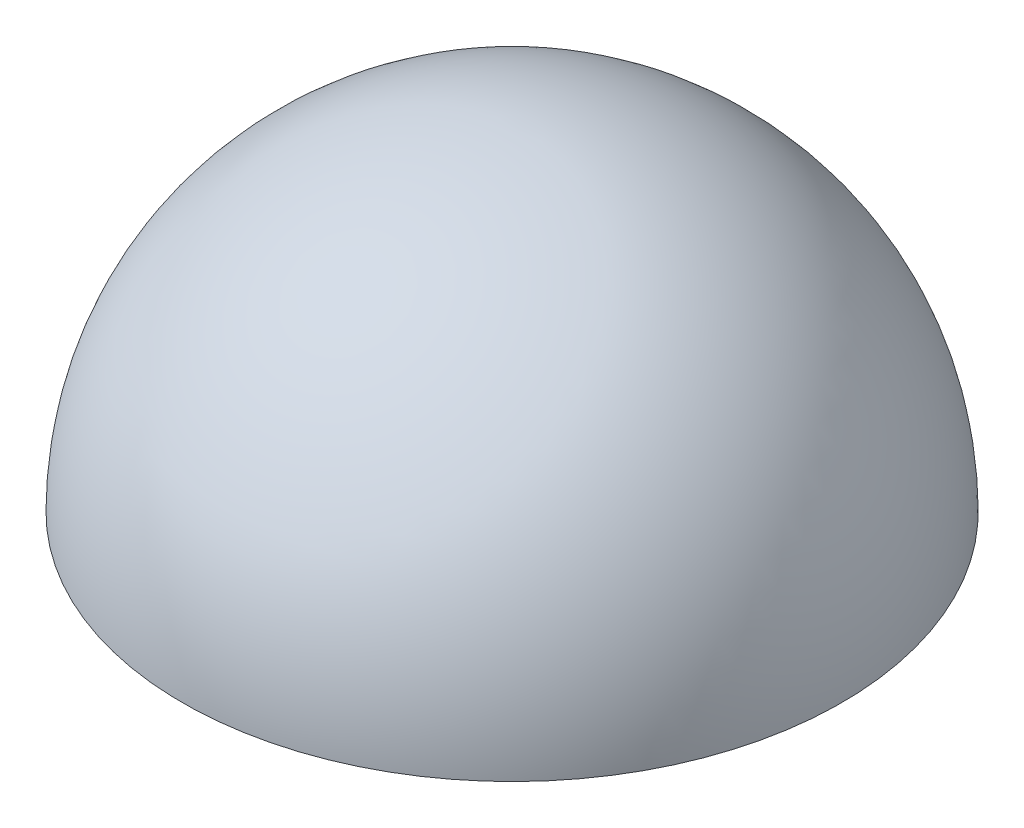
ISO-10303-21;
HEADER;
FILE_DESCRIPTION(('STEP AP214'),'2;1');
FILE_NAME('part.step','',(''),(''),'','','');
FILE_SCHEMA(('AUTOMOTIVE_DESIGN { 1 0 10303 214 1 1 1 1 }'));
ENDSEC;
DATA;
#1=APPLICATION_CONTEXT('core data for automotive mechanical design processes');
#2=APPLICATION_PROTOCOL_DEFINITION('international standard','automotive_design',2000,#1);
#3=PRODUCT_CONTEXT('',#1,'mechanical');
#4=PRODUCT('Part','Part','',(#3));
#5=PRODUCT_RELATED_PRODUCT_CATEGORY('part','',(#4));
#6=PRODUCT_DEFINITION_FORMATION('','',#4);
#7=PRODUCT_DEFINITION_CONTEXT('part definition',#1,'design');
#8=PRODUCT_DEFINITION('design','',#6,#7);
#9=PRODUCT_DEFINITION_SHAPE('','',#8);
#10=(LENGTH_UNIT() NAMED_UNIT(*) SI_UNIT(.MILLI.,.METRE.));
#11=(NAMED_UNIT(*) PLANE_ANGLE_UNIT() SI_UNIT($,.RADIAN.));
#12=(NAMED_UNIT(*) SI_UNIT($,.STERADIAN.) SOLID_ANGLE_UNIT());
#13=UNCERTAINTY_MEASURE_WITH_UNIT(LENGTH_MEASURE(1.E-05),#10,'distance_accuracy_value','');
#14=(GEOMETRIC_REPRESENTATION_CONTEXT(3) GLOBAL_UNCERTAINTY_ASSIGNED_CONTEXT((#13)) GLOBAL_UNIT_ASSIGNED_CONTEXT((#10,
#11,#12)) REPRESENTATION_CONTEXT('',''));
#15=CARTESIAN_POINT('',(0.,0.,0.));
#16=DIRECTION('',(0.,0.,1.));
#17=DIRECTION('',(1.,0.,0.));
#18=AXIS2_PLACEMENT_3D('',#15,#16,#17);
#19=CARTESIAN_POINT('',(0.,0.,0.));
#20=DIRECTION('',(-1.,0.,0.));
#21=DIRECTION('',(0.,0.,1.));
#22=AXIS2_PLACEMENT_3D('',#19,#20,#21);
#23=SPHERICAL_SURFACE('',#22,31.5);
#24=CARTESIAN_POINT('',(0.,0.,0.));
#25=DIRECTION('',(0.,-1.,0.));
#26=DIRECTION('',(0.,0.,-1.));
#27=AXIS2_PLACEMENT_3D('',#24,#25,#26);
#28=SPHERICAL_SURFACE('',#27,31.5);
#29=CARTESIAN_POINT('',(0.,0.,0.));
#30=DIRECTION('',(0.,-1.,0.));
#31=DIRECTION('',(0.,0.,-1.));
#32=AXIS2_PLACEMENT_3D('',#29,#30,#31);
#33=CIRCLE('',#32,31.5);
#34=CARTESIAN_POINT('',(0.,2.19963324347117E-13,-31.5));
#35=VERTEX_POINT('',#34);
#36=EDGE_CURVE('E45',#35,#35,#33,.T.);
#37=ORIENTED_EDGE('',*,*,#36,.F.);
#38=EDGE_LOOP('',(#37));
#39=FACE_BOUND('',#38,.T.);
#40=ADVANCED_FACE('F37',(#39),#28,.T.);
#41=CARTESIAN_POINT('',(0.,0.,0.));
#42=DIRECTION('',(-1.,0.,0.));
#43=DIRECTION('',(0.,0.,1.));
#44=AXIS2_PLACEMENT_3D('',#41,#42,#43);
#45=SPHERICAL_SURFACE('',#44,30.);
#46=CARTESIAN_POINT('',(0.,0.,0.));
#47=DIRECTION('',(0.,-1.,0.));
#48=DIRECTION('',(0.,0.,-1.));
#49=AXIS2_PLACEMENT_3D('',#46,#47,#48);
#50=SPHERICAL_SURFACE('',#49,30.);
#51=CARTESIAN_POINT('',(0.,0.,0.));
#52=DIRECTION('',(0.,-1.,0.));
#53=DIRECTION('',(0.,0.,-1.));
#54=AXIS2_PLACEMENT_3D('',#51,#52,#53);
#55=CIRCLE('',#54,30.);
#56=CARTESIAN_POINT('',(0.,2.09488880330588E-13,-30.));
#57=VERTEX_POINT('',#56);
#58=EDGE_CURVE('E10',#57,#57,#55,.T.);
#59=ORIENTED_EDGE('',*,*,#58,.T.);
#60=EDGE_LOOP('',(#59));
#61=FACE_BOUND('',#60,.T.);
#62=ADVANCED_FACE('F39',(#61),#50,.F.);
#63=CARTESIAN_POINT('',(0.,0.,0.));
#64=DIRECTION('',(0.,-1.,0.));
#65=DIRECTION('',(0.,0.,-1.));
#66=AXIS2_PLACEMENT_3D('',#63,#64,#65);
#67=PLANE('',#66);
#68=ORIENTED_EDGE('',*,*,#58,.F.);
#69=EDGE_LOOP('',(#68));
#70=FACE_BOUND('',#69,.T.);
#71=ORIENTED_EDGE('',*,*,#36,.T.);
#72=EDGE_LOOP('',(#71));
#73=FACE_BOUND('',#72,.T.);
#74=ADVANCED_FACE('F52',(#70,#73),#67,.T.);
#75=CLOSED_SHELL('',(#40,#62,#74));
#76=MANIFOLD_SOLID_BREP('B2',#75);
#77=ADVANCED_BREP_SHAPE_REPRESENTATION('',(#18,#76),#14);
#78=SHAPE_DEFINITION_REPRESENTATION(#9,#77);
ENDSEC;
END-ISO-10303-21;
